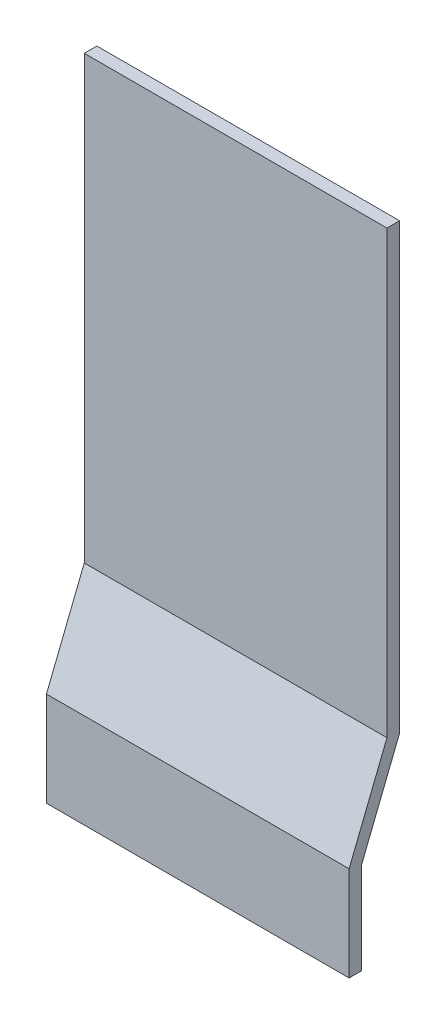
ISO-10303-21;
HEADER;
FILE_DESCRIPTION(('STEP AP214'),'2;1');
FILE_NAME('part.step','',(''),(''),'','','');
FILE_SCHEMA(('AUTOMOTIVE_DESIGN { 1 0 10303 214 1 1 1 1 }'));
ENDSEC;
DATA;
#1=APPLICATION_CONTEXT('core data for automotive mechanical design processes');
#2=APPLICATION_PROTOCOL_DEFINITION('international standard','automotive_design',2000,#1);
#3=PRODUCT_CONTEXT('',#1,'mechanical');
#4=PRODUCT('Part','Part','',(#3));
#5=PRODUCT_RELATED_PRODUCT_CATEGORY('part','',(#4));
#6=PRODUCT_DEFINITION_FORMATION('','',#4);
#7=PRODUCT_DEFINITION_CONTEXT('part definition',#1,'design');
#8=PRODUCT_DEFINITION('design','',#6,#7);
#9=PRODUCT_DEFINITION_SHAPE('','',#8);
#10=(LENGTH_UNIT() NAMED_UNIT(*) SI_UNIT(.MILLI.,.METRE.));
#11=(NAMED_UNIT(*) PLANE_ANGLE_UNIT() SI_UNIT($,.RADIAN.));
#12=(NAMED_UNIT(*) SI_UNIT($,.STERADIAN.) SOLID_ANGLE_UNIT());
#13=UNCERTAINTY_MEASURE_WITH_UNIT(LENGTH_MEASURE(1.E-05),#10,'distance_accuracy_value','');
#14=(GEOMETRIC_REPRESENTATION_CONTEXT(3) GLOBAL_UNCERTAINTY_ASSIGNED_CONTEXT((#13)) GLOBAL_UNIT_ASSIGNED_CONTEXT((#10,
#11,#12)) REPRESENTATION_CONTEXT('',''));
#15=CARTESIAN_POINT('',(0.,0.,0.));
#16=DIRECTION('',(0.,0.,1.));
#17=DIRECTION('',(1.,0.,0.));
#18=AXIS2_PLACEMENT_3D('',#15,#16,#17);
#19=CARTESIAN_POINT('',(-20.47728245926,4.697980609798,-26.23448402181));
#20=DIRECTION('',(0.,0.,-1.));
#21=DIRECTION('',(-1.,0.,0.));
#22=AXIS2_PLACEMENT_3D('',#19,#20,#21);
#23=PLANE('',#22);
#24=DIRECTION('',(0.,1.,0.));
#25=VECTOR('',#24,1.);
#26=CARTESIAN_POINT('',(-24.37728245926,4.697980609798,-26.23448402181));
#27=LINE('',#26,#25);
#28=CARTESIAN_POINT('',(-24.37728245926,4.697980609798,-26.23448402181));
#29=VERTEX_POINT('',#28);
#30=CARTESIAN_POINT('',(-24.37728245926,3.947980609798,-26.23448402181));
#31=VERTEX_POINT('',#30);
#32=EDGE_CURVE('E78',#29,#31,#27,.F.);
#33=ORIENTED_EDGE('',*,*,#32,.F.);
#34=DIRECTION('',(1.,0.,0.));
#35=VECTOR('',#34,1.);
#36=CARTESIAN_POINT('',(-20.47728245926,4.697980609798,-26.23448402181));
#37=LINE('',#36,#35);
#38=CARTESIAN_POINT('',(-26.77728245926,4.697980609798,-26.23448402181));
#39=VERTEX_POINT('',#38);
#40=EDGE_CURVE('E88',#29,#39,#37,.F.);
#41=ORIENTED_EDGE('',*,*,#40,.T.);
#42=DIRECTION('',(0.,1.,0.));
#43=VECTOR('',#42,1.);
#44=CARTESIAN_POINT('',(-26.77728245926,4.697980609798,-26.23448402181));
#45=LINE('',#44,#43);
#46=CARTESIAN_POINT('',(-26.77728245926,3.947980609798,-26.23448402181));
#47=VERTEX_POINT('',#46);
#48=EDGE_CURVE('E20',#47,#39,#45,.T.);
#49=ORIENTED_EDGE('',*,*,#48,.F.);
#50=DIRECTION('',(1.,0.,0.));
#51=VECTOR('',#50,1.);
#52=CARTESIAN_POINT('',(-20.47728245926,3.947980609798,-26.23448402181));
#53=LINE('',#52,#51);
#54=EDGE_CURVE('E86',#47,#31,#53,.T.);
#55=ORIENTED_EDGE('',*,*,#54,.T.);
#56=EDGE_LOOP('',(#33,#41,#49,#55));
#57=FACE_BOUND('',#56,.T.);
#58=ADVANCED_FACE('F17',(#57),#23,.F.);
#59=CARTESIAN_POINT('',(-20.47728245926,3.947980609798,-26.23448402181));
#60=DIRECTION('',(0.,1.,0.));
#61=DIRECTION('',(0.,0.,1.));
#62=AXIS2_PLACEMENT_3D('',#59,#60,#61);
#63=PLANE('',#62);
#64=DIRECTION('',(0.,0.,1.));
#65=VECTOR('',#64,1.);
#66=CARTESIAN_POINT('',(-24.37728245926,3.947980609798,-26.23448402181));
#67=LINE('',#66,#65);
#68=CARTESIAN_POINT('',(-24.37728245926,3.947980609798,-26.33448402181));
#69=VERTEX_POINT('',#68);
#70=EDGE_CURVE('E96',#31,#69,#67,.F.);
#71=ORIENTED_EDGE('',*,*,#70,.F.);
#72=ORIENTED_EDGE('',*,*,#54,.F.);
#73=DIRECTION('',(0.,0.,1.));
#74=VECTOR('',#73,1.);
#75=CARTESIAN_POINT('',(-26.77728245926,3.947980609798,-26.23448402181));
#76=LINE('',#75,#74);
#77=CARTESIAN_POINT('',(-26.77728245926,3.947980609798,-26.33448402181));
#78=VERTEX_POINT('',#77);
#79=EDGE_CURVE('E94',#78,#47,#76,.T.);
#80=ORIENTED_EDGE('',*,*,#79,.F.);
#81=DIRECTION('',(1.,0.,0.));
#82=VECTOR('',#81,1.);
#83=CARTESIAN_POINT('',(-20.47728245926,3.947980609798,-26.33448402181));
#84=LINE('',#83,#82);
#85=EDGE_CURVE('E111',#78,#69,#84,.T.);
#86=ORIENTED_EDGE('',*,*,#85,.T.);
#87=EDGE_LOOP('',(#71,#72,#80,#86));
#88=FACE_BOUND('',#87,.T.);
#89=ADVANCED_FACE('F92',(#88),#63,.F.);
#90=CARTESIAN_POINT('',(-20.47728245926,5.447980609798,-26.53448402181));
#91=DIRECTION('',(0.,-0.371390676354104,-0.928476690885259));
#92=DIRECTION('',(0.,0.928476690885259,-0.371390676354104));
#93=AXIS2_PLACEMENT_3D('',#90,#91,#92);
#94=PLANE('',#93);
#95=DIRECTION('',(0.,0.928476690885259,-0.371390676354104));
#96=VECTOR('',#95,1.);
#97=CARTESIAN_POINT('',(-24.37728245926,5.447980609798,-26.53448402181));
#98=LINE('',#97,#96);
#99=CARTESIAN_POINT('',(-24.37728245926,5.447980609798,-26.53448402181));
#100=VERTEX_POINT('',#99);
#101=EDGE_CURVE('E108',#100,#29,#98,.F.);
#102=ORIENTED_EDGE('',*,*,#101,.F.);
#103=DIRECTION('',(1.,0.,0.));
#104=VECTOR('',#103,1.);
#105=CARTESIAN_POINT('',(-20.47728245926,5.447980609798,-26.53448402181));
#106=LINE('',#105,#104);
#107=CARTESIAN_POINT('',(-26.77728245926,5.447980609798,-26.53448402181));
#108=VERTEX_POINT('',#107);
#109=EDGE_CURVE('E115',#100,#108,#106,.F.);
#110=ORIENTED_EDGE('',*,*,#109,.T.);
#111=DIRECTION('',(0.,0.928476690885259,-0.371390676354104));
#112=VECTOR('',#111,1.);
#113=CARTESIAN_POINT('',(-26.77728245926,5.447980609798,-26.53448402181));
#114=LINE('',#113,#112);
#115=EDGE_CURVE('E106',#39,#108,#114,.T.);
#116=ORIENTED_EDGE('',*,*,#115,.F.);
#117=ORIENTED_EDGE('',*,*,#40,.F.);
#118=EDGE_LOOP('',(#102,#110,#116,#117));
#119=FACE_BOUND('',#118,.T.);
#120=ADVANCED_FACE('F177',(#119),#94,.F.);
#121=CARTESIAN_POINT('',(-20.47728245926,4.678722369441,-26.33448402181));
#122=DIRECTION('',(0.,0.,1.));
#123=DIRECTION('',(1.,0.,0.));
#124=AXIS2_PLACEMENT_3D('',#121,#122,#123);
#125=PLANE('',#124);
#126=DIRECTION('',(0.,1.,0.));
#127=VECTOR('',#126,1.);
#128=CARTESIAN_POINT('',(-24.37728245926,4.678722369441,-26.33448402181));
#129=LINE('',#128,#127);
#130=CARTESIAN_POINT('',(-24.37728245926,4.678722369441,-26.33448402181));
#131=VERTEX_POINT('',#130);
#132=EDGE_CURVE('E113',#69,#131,#129,.T.);
#133=ORIENTED_EDGE('',*,*,#132,.F.);
#134=ORIENTED_EDGE('',*,*,#85,.F.);
#135=DIRECTION('',(0.,1.,0.));
#136=VECTOR('',#135,1.);
#137=CARTESIAN_POINT('',(-26.77728245926,3.947980609798,-26.33448402181));
#138=LINE('',#137,#136);
#139=CARTESIAN_POINT('',(-26.77728245926,4.678722369441,-26.33448402181));
#140=VERTEX_POINT('',#139);
#141=EDGE_CURVE('E102',#78,#140,#138,.T.);
#142=ORIENTED_EDGE('',*,*,#141,.T.);
#143=DIRECTION('',(1.,0.,0.));
#144=VECTOR('',#143,1.);
#145=CARTESIAN_POINT('',(-20.47728245926,4.678722369441,-26.33448402181));
#146=LINE('',#145,#144);
#147=EDGE_CURVE('E124',#140,#131,#146,.T.);
#148=ORIENTED_EDGE('',*,*,#147,.T.);
#149=EDGE_LOOP('',(#133,#134,#142,#148));
#150=FACE_BOUND('',#149,.T.);
#151=ADVANCED_FACE('F173',(#150),#125,.F.);
#152=CARTESIAN_POINT('',(-20.47728245926,8.947980609798,-26.53448402181));
#153=DIRECTION('',(0.,0.,-1.));
#154=DIRECTION('',(0.,1.,0.));
#155=AXIS2_PLACEMENT_3D('',#152,#153,#154);
#156=PLANE('',#155);
#157=DIRECTION('',(0.,-1.,0.));
#158=VECTOR('',#157,1.);
#159=CARTESIAN_POINT('',(-24.37728245926,8.947980609798,-26.53448402181));
#160=LINE('',#159,#158);
#161=CARTESIAN_POINT('',(-24.37728245926,8.947980609798,-26.53448402181));
#162=VERTEX_POINT('',#161);
#163=EDGE_CURVE('E127',#100,#162,#160,.F.);
#164=ORIENTED_EDGE('',*,*,#163,.T.);
#165=DIRECTION('',(1.,0.,0.));
#166=VECTOR('',#165,1.);
#167=CARTESIAN_POINT('',(-20.47728245926,8.947980609798,-26.53448402181));
#168=LINE('',#167,#166);
#169=CARTESIAN_POINT('',(-26.77728245926,8.947980609798,-26.53448402181));
#170=VERTEX_POINT('',#169);
#171=EDGE_CURVE('E135',#162,#170,#168,.F.);
#172=ORIENTED_EDGE('',*,*,#171,.T.);
#173=DIRECTION('',(0.,1.,0.));
#174=VECTOR('',#173,1.);
#175=CARTESIAN_POINT('',(-26.77728245926,3.947980609798,-26.53448402181));
#176=LINE('',#175,#174);
#177=EDGE_CURVE('E119',#170,#108,#176,.F.);
#178=ORIENTED_EDGE('',*,*,#177,.T.);
#179=ORIENTED_EDGE('',*,*,#109,.F.);
#180=EDGE_LOOP('',(#164,#172,#178,#179));
#181=FACE_BOUND('',#180,.T.);
#182=ADVANCED_FACE('F170',(#181),#156,.F.);
#183=CARTESIAN_POINT('',(-26.77728245926,3.947980609798,-26.53448402181));
#184=DIRECTION('',(1.,0.,0.));
#185=DIRECTION('',(0.,0.,-1.));
#186=AXIS2_PLACEMENT_3D('',#183,#184,#185);
#187=PLANE('',#186);
#188=DIRECTION('',(0.,0.,-1.));
#189=VECTOR('',#188,1.);
#190=CARTESIAN_POINT('',(-26.77728245926,8.947980609798,-26.53448402181));
#191=LINE('',#190,#189);
#192=CARTESIAN_POINT('',(-26.77728245926,8.947980609798,-26.63448402181));
#193=VERTEX_POINT('',#192);
#194=EDGE_CURVE('E132',#170,#193,#191,.T.);
#195=ORIENTED_EDGE('',*,*,#194,.T.);
#196=DIRECTION('',(0.,1.,0.));
#197=VECTOR('',#196,1.);
#198=CARTESIAN_POINT('',(-26.77728245926,8.947980609798,-26.63448402181));
#199=LINE('',#198,#197);
#200=CARTESIAN_POINT('',(-26.77728245926,5.428722369441,-26.63448402181));
#201=VERTEX_POINT('',#200);
#202=EDGE_CURVE('E138',#193,#201,#199,.F.);
#203=ORIENTED_EDGE('',*,*,#202,.T.);
#204=DIRECTION('',(0.,-0.928476690885259,0.371390676354104));
#205=VECTOR('',#204,1.);
#206=CARTESIAN_POINT('',(-26.77728245926,5.428722369441,-26.63448402181));
#207=LINE('',#206,#205);
#208=EDGE_CURVE('E122',#201,#140,#207,.T.);
#209=ORIENTED_EDGE('',*,*,#208,.T.);
#210=ORIENTED_EDGE('',*,*,#141,.F.);
#211=ORIENTED_EDGE('',*,*,#79,.T.);
#212=ORIENTED_EDGE('',*,*,#48,.T.);
#213=ORIENTED_EDGE('',*,*,#115,.T.);
#214=ORIENTED_EDGE('',*,*,#177,.F.);
#215=EDGE_LOOP('',(#195,#203,#209,#210,#211,#212,#213,#214));
#216=FACE_BOUND('',#215,.T.);
#217=ADVANCED_FACE('F100',(#216),#187,.F.);
#218=CARTESIAN_POINT('',(-20.47728245926,5.428722369441,-26.63448402181));
#219=DIRECTION('',(0.,0.371390676354104,0.928476690885259));
#220=DIRECTION('',(0.,-0.928476690885259,0.371390676354104));
#221=AXIS2_PLACEMENT_3D('',#218,#219,#220);
#222=PLANE('',#221);
#223=DIRECTION('',(0.,-0.928476690885259,0.371390676354106));
#224=VECTOR('',#223,1.);
#225=CARTESIAN_POINT('',(-24.37728245926,5.428722369441,-26.63448402181));
#226=LINE('',#225,#224);
#227=CARTESIAN_POINT('',(-24.37728245926,5.428722369441,-26.63448402181));
#228=VERTEX_POINT('',#227);
#229=EDGE_CURVE('E129',#228,#131,#226,.T.);
#230=ORIENTED_EDGE('',*,*,#229,.T.);
#231=ORIENTED_EDGE('',*,*,#147,.F.);
#232=ORIENTED_EDGE('',*,*,#208,.F.);
#233=DIRECTION('',(1.,0.,0.));
#234=VECTOR('',#233,1.);
#235=CARTESIAN_POINT('',(-20.47728245926,5.428722369441,-26.63448402181));
#236=LINE('',#235,#234);
#237=EDGE_CURVE('E141',#201,#228,#236,.T.);
#238=ORIENTED_EDGE('',*,*,#237,.T.);
#239=EDGE_LOOP('',(#230,#231,#232,#238));
#240=FACE_BOUND('',#239,.T.);
#241=ADVANCED_FACE('F152',(#240),#222,.F.);
#242=CARTESIAN_POINT('',(-24.37728245926,8.947980609798,-21.01433076735));
#243=DIRECTION('',(-1.,0.,0.));
#244=DIRECTION('',(0.,-1.,0.));
#245=AXIS2_PLACEMENT_3D('',#242,#243,#244);
#246=PLANE('',#245);
#247=ORIENTED_EDGE('',*,*,#32,.T.);
#248=ORIENTED_EDGE('',*,*,#70,.T.);
#249=ORIENTED_EDGE('',*,*,#132,.T.);
#250=ORIENTED_EDGE('',*,*,#229,.F.);
#251=DIRECTION('',(0.,1.,0.));
#252=VECTOR('',#251,1.);
#253=CARTESIAN_POINT('',(-24.37728245926,8.947980609798,-26.63448402181));
#254=LINE('',#253,#252);
#255=CARTESIAN_POINT('',(-24.37728245926,8.947980609798,-26.63448402181));
#256=VERTEX_POINT('',#255);
#257=EDGE_CURVE('E26',#228,#256,#254,.T.);
#258=ORIENTED_EDGE('',*,*,#257,.T.);
#259=DIRECTION('',(0.,0.,-1.));
#260=VECTOR('',#259,1.);
#261=CARTESIAN_POINT('',(-24.37728245926,8.947980609798,-26.53448402181));
#262=LINE('',#261,#260);
#263=EDGE_CURVE('E34',#256,#162,#262,.F.);
#264=ORIENTED_EDGE('',*,*,#263,.T.);
#265=ORIENTED_EDGE('',*,*,#163,.F.);
#266=ORIENTED_EDGE('',*,*,#101,.T.);
#267=EDGE_LOOP('',(#247,#248,#249,#250,#258,#264,#265,#266));
#268=FACE_BOUND('',#267,.T.);
#269=ADVANCED_FACE('F146',(#268),#246,.F.);
#270=CARTESIAN_POINT('',(-20.47728245926,8.947980609798,-26.53448402181));
#271=DIRECTION('',(0.,-1.,0.));
#272=DIRECTION('',(0.,0.,-1.));
#273=AXIS2_PLACEMENT_3D('',#270,#271,#272);
#274=PLANE('',#273);
#275=ORIENTED_EDGE('',*,*,#263,.F.);
#276=DIRECTION('',(1.,0.,0.));
#277=VECTOR('',#276,1.);
#278=CARTESIAN_POINT('',(-20.47728245926,8.947980609798,-26.63448402181));
#279=LINE('',#278,#277);
#280=EDGE_CURVE('E11',#256,#193,#279,.F.);
#281=ORIENTED_EDGE('',*,*,#280,.T.);
#282=ORIENTED_EDGE('',*,*,#194,.F.);
#283=ORIENTED_EDGE('',*,*,#171,.F.);
#284=EDGE_LOOP('',(#275,#281,#282,#283));
#285=FACE_BOUND('',#284,.T.);
#286=ADVANCED_FACE('F155',(#285),#274,.F.);
#287=CARTESIAN_POINT('',(-20.47728245926,8.947980609798,-26.63448402181));
#288=DIRECTION('',(0.,0.,1.));
#289=DIRECTION('',(1.,0.,0.));
#290=AXIS2_PLACEMENT_3D('',#287,#288,#289);
#291=PLANE('',#290);
#292=ORIENTED_EDGE('',*,*,#257,.F.);
#293=ORIENTED_EDGE('',*,*,#237,.F.);
#294=ORIENTED_EDGE('',*,*,#202,.F.);
#295=ORIENTED_EDGE('',*,*,#280,.F.);
#296=EDGE_LOOP('',(#292,#293,#294,#295));
#297=FACE_BOUND('',#296,.T.);
#298=ADVANCED_FACE('F150',(#297),#291,.F.);
#299=CLOSED_SHELL('',(#58,#89,#120,#151,#182,#217,#241,#269,#286,#298));
#300=MANIFOLD_SOLID_BREP('B1',#299);
#301=ADVANCED_BREP_SHAPE_REPRESENTATION('',(#18,#300),#14);
#302=SHAPE_DEFINITION_REPRESENTATION(#9,#301);
ENDSEC;
END-ISO-10303-21;
